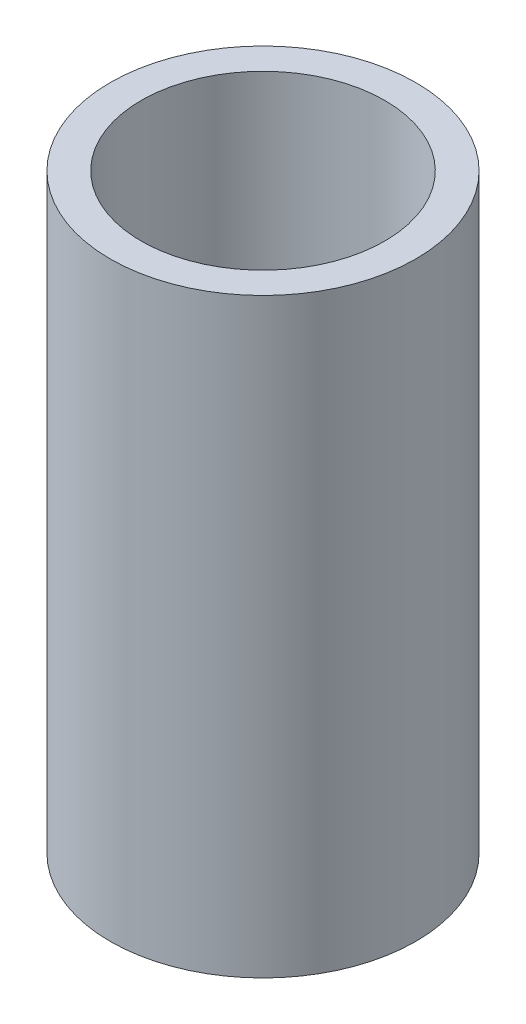
ISO-10303-21;
HEADER;
FILE_DESCRIPTION(('STEP AP214'),'2;1');
FILE_NAME('part.step','',(''),(''),'','','');
FILE_SCHEMA(('AUTOMOTIVE_DESIGN { 1 0 10303 214 1 1 1 1 }'));
ENDSEC;
DATA;
#1=APPLICATION_CONTEXT('core data for automotive mechanical design processes');
#2=APPLICATION_PROTOCOL_DEFINITION('international standard','automotive_design',2000,#1);
#3=PRODUCT_CONTEXT('',#1,'mechanical');
#4=PRODUCT('Part','Part','',(#3));
#5=PRODUCT_RELATED_PRODUCT_CATEGORY('part','',(#4));
#6=PRODUCT_DEFINITION_FORMATION('','',#4);
#7=PRODUCT_DEFINITION_CONTEXT('part definition',#1,'design');
#8=PRODUCT_DEFINITION('design','',#6,#7);
#9=PRODUCT_DEFINITION_SHAPE('','',#8);
#10=(LENGTH_UNIT() NAMED_UNIT(*) SI_UNIT(.MILLI.,.METRE.));
#11=(NAMED_UNIT(*) PLANE_ANGLE_UNIT() SI_UNIT($,.RADIAN.));
#12=(NAMED_UNIT(*) SI_UNIT($,.STERADIAN.) SOLID_ANGLE_UNIT());
#13=UNCERTAINTY_MEASURE_WITH_UNIT(LENGTH_MEASURE(1.E-05),#10,'distance_accuracy_value','');
#14=(GEOMETRIC_REPRESENTATION_CONTEXT(3) GLOBAL_UNCERTAINTY_ASSIGNED_CONTEXT((#13)) GLOBAL_UNIT_ASSIGNED_CONTEXT((#10,
#11,#12)) REPRESENTATION_CONTEXT('',''));
#15=CARTESIAN_POINT('',(0.,0.,0.));
#16=DIRECTION('',(0.,0.,1.));
#17=DIRECTION('',(1.,0.,0.));
#18=AXIS2_PLACEMENT_3D('',#15,#16,#17);
#19=CARTESIAN_POINT('',(0.,106.386436570976,0.));
#20=DIRECTION('',(0.,-1.,0.));
#21=DIRECTION('',(0.,0.,-1.));
#22=AXIS2_PLACEMENT_3D('',#19,#20,#21);
#23=CYLINDRICAL_SURFACE('',#22,27.5);
#24=CARTESIAN_POINT('',(0.,106.386436570976,0.));
#25=DIRECTION('',(0.,1.,0.));
#26=DIRECTION('',(0.,0.,1.));
#27=AXIS2_PLACEMENT_3D('',#24,#25,#26);
#28=CIRCLE('',#27,27.5);
#29=CARTESIAN_POINT('',(0.,106.386436570976,-27.5));
#30=VERTEX_POINT('',#29);
#31=EDGE_CURVE('E10',#30,#30,#28,.T.);
#32=CARTESIAN_POINT('',(0.,0.,0.));
#33=DIRECTION('',(0.,1.,0.));
#34=DIRECTION('',(0.,0.,1.));
#35=AXIS2_PLACEMENT_3D('',#32,#33,#34);
#36=CIRCLE('',#35,27.5);
#37=CARTESIAN_POINT('',(0.,0.,-27.5));
#38=VERTEX_POINT('',#37);
#39=EDGE_CURVE('E37',#38,#38,#36,.T.);
#40=CARTESIAN_POINT('',(0.,106.386436570976,-27.5));
#41=CARTESIAN_POINT('',(0.,105.278244523362,-27.5));
#42=CARTESIAN_POINT('',(0.,104.170052475747,-27.5));
#43=CARTESIAN_POINT('',(0.,101.953668380519,-27.5));
#44=CARTESIAN_POINT('',(0.,100.845476332904,-27.5));
#45=CARTESIAN_POINT('',(0.,98.6290922376758,-27.5));
#46=CARTESIAN_POINT('',(0.,97.5209001900615,-27.5));
#47=CARTESIAN_POINT('',(0.,95.3045160948328,-27.5));
#48=CARTESIAN_POINT('',(0.,94.1963240472185,-27.5));
#49=CARTESIAN_POINT('',(0.,91.9799399519898,-27.5));
#50=CARTESIAN_POINT('',(0.,90.8717479043755,-27.5));
#51=CARTESIAN_POINT('',(0.,88.6553638091468,-27.5));
#52=CARTESIAN_POINT('',(0.,87.5471717615325,-27.5));
#53=CARTESIAN_POINT('',(0.,85.3307876663038,-27.5));
#54=CARTESIAN_POINT('',(0.,84.2225956186895,-27.5));
#55=CARTESIAN_POINT('',(0.,82.0062115234608,-27.5));
#56=CARTESIAN_POINT('',(0.,80.8980194758465,-27.5));
#57=CARTESIAN_POINT('',(0.,78.6816353806178,-27.5));
#58=CARTESIAN_POINT('',(0.,77.5734433330035,-27.5));
#59=CARTESIAN_POINT('',(0.,75.3570592377748,-27.5));
#60=CARTESIAN_POINT('',(0.,74.2488671901605,-27.5));
#61=CARTESIAN_POINT('',(0.,72.0324830949318,-27.5));
#62=CARTESIAN_POINT('',(0.,70.9242910473175,-27.5));
#63=CARTESIAN_POINT('',(0.,68.7079069520888,-27.5));
#64=CARTESIAN_POINT('',(0.,67.5997149044744,-27.5));
#65=CARTESIAN_POINT('',(0.,65.3833308092458,-27.5));
#66=CARTESIAN_POINT('',(0.,64.2751387616314,-27.5));
#67=CARTESIAN_POINT('',(0.,62.0587546664028,-27.5));
#68=CARTESIAN_POINT('',(0.,60.9505626187884,-27.5));
#69=CARTESIAN_POINT('',(0.,58.7341785235598,-27.5));
#70=CARTESIAN_POINT('',(0.,57.6259864759454,-27.5));
#71=CARTESIAN_POINT('',(0.,55.4096023807168,-27.5));
#72=CARTESIAN_POINT('',(0.,54.3014103331024,-27.5));
#73=CARTESIAN_POINT('',(0.,52.0850262378737,-27.5));
#74=CARTESIAN_POINT('',(0.,50.9768341902594,-27.5));
#75=CARTESIAN_POINT('',(0.,48.7604500950307,-27.5));
#76=CARTESIAN_POINT('',(0.,47.6522580474164,-27.5));
#77=CARTESIAN_POINT('',(0.,45.4358739521877,-27.5));
#78=CARTESIAN_POINT('',(0.,44.3276819045734,-27.5));
#79=CARTESIAN_POINT('',(0.,42.1112978093447,-27.5));
#80=CARTESIAN_POINT('',(0.,41.0031057617304,-27.5));
#81=CARTESIAN_POINT('',(0.,38.7867216665017,-27.5));
#82=CARTESIAN_POINT('',(0.,37.6785296188874,-27.5));
#83=CARTESIAN_POINT('',(0.,35.4621455236587,-27.5));
#84=CARTESIAN_POINT('',(0.,34.3539534760444,-27.5));
#85=CARTESIAN_POINT('',(0.,32.1375693808157,-27.5));
#86=CARTESIAN_POINT('',(0.,31.0293773332014,-27.5));
#87=CARTESIAN_POINT('',(0.,28.8129932379727,-27.5));
#88=CARTESIAN_POINT('',(0.,27.7048011903584,-27.5));
#89=CARTESIAN_POINT('',(0.,25.4884170951297,-27.5));
#90=CARTESIAN_POINT('',(0.,24.3802250475154,-27.5));
#91=CARTESIAN_POINT('',(0.,22.1638409522867,-27.5));
#92=CARTESIAN_POINT('',(0.,21.0556489046724,-27.5));
#93=CARTESIAN_POINT('',(0.,18.8392648094437,-27.5));
#94=CARTESIAN_POINT('',(0.,17.7310727618294,-27.5));
#95=CARTESIAN_POINT('',(0.,15.5146886666007,-27.5));
#96=CARTESIAN_POINT('',(0.,14.4064966189864,-27.5));
#97=CARTESIAN_POINT('',(0.,12.1901125237577,-27.5));
#98=CARTESIAN_POINT('',(0.,11.0819204761434,-27.5));
#99=CARTESIAN_POINT('',(0.,8.86553638091468,-27.5));
#100=CARTESIAN_POINT('',(0.,7.75734433330035,-27.5));
#101=CARTESIAN_POINT('',(0.,5.54096023807168,-27.5));
#102=CARTESIAN_POINT('',(0.,4.43276819045734,-27.5));
#103=CARTESIAN_POINT('',(0.,2.21638409522867,-27.5));
#104=CARTESIAN_POINT('',(0.,1.10819204761434,-27.5));
#105=CARTESIAN_POINT('',(0.,0.,-27.5));
#106=B_SPLINE_CURVE_WITH_KNOTS('',3,(#40,#41,#42,#43,#44,#45,#46,#47,#48,#49,#50,#51,#52,#53,
#54,#55,#56,#57,#58,#59,#60,#61,#62,#63,#64,#65,#66,#67,#68,#69,#70,#71,#72,#73,#74,#75,#76,#77,
#78,#79,#80,#81,#82,#83,#84,#85,#86,#87,#88,#89,#90,#91,#92,#93,#94,#95,#96,#97,#98,#99,#100,
#101,#102,#103,#104,#105),.UNSPECIFIED.,.F.,.F.,(4,2,2,2,2,2,2,2,2,2,2,2,2,2,2,2,2,2,2,2,2,2,2,
2,2,2,2,2,2,2,2,2,4),(0.,3.324576142843,6.64915228568601,9.97372842852901,13.298304571372,
16.622880714215,19.947456857058,23.272032999901,26.596609142744,29.921185285587,33.24576142843,
36.570337571273,39.8949137141161,43.2194898569591,46.5440659998021,49.8686421426451,
53.1932182854881,56.5177944283311,59.8423705711741,63.1669467140171,66.4915228568601,
69.8160989997031,73.1406751425461,76.4652512853891,79.7898274282321,83.1144035710751,
86.4389797139181,89.7635558567611,93.0881319996041,96.4127081424471,99.7372842852901,
103.061860428133,106.386436570976),.UNSPECIFIED.);
#107=EDGE_CURVE('BSEAM40',#30,#38,#106,.T.);
#108=ORIENTED_EDGE('',*,*,#31,.F.);
#109=ORIENTED_EDGE('',*,*,#39,.T.);
#110=ORIENTED_EDGE('',*,*,#107,.T.);
#111=ORIENTED_EDGE('',*,*,#107,.F.);
#112=EDGE_LOOP('',(#108,#110,#109,#111));
#113=FACE_BOUND('',#112,.T.);
#114=ADVANCED_FACE('F40',(#113),#23,.T.);
#115=CARTESIAN_POINT('',(0.,106.386436570976,0.));
#116=DIRECTION('',(0.,1.,0.));
#117=DIRECTION('',(0.,0.,1.));
#118=AXIS2_PLACEMENT_3D('',#115,#116,#117);
#119=PLANE('',#118);
#120=CARTESIAN_POINT('',(0.,106.386436570976,0.));
#121=DIRECTION('',(0.,1.,0.));
#122=DIRECTION('',(0.,0.,1.));
#123=AXIS2_PLACEMENT_3D('',#120,#121,#122);
#124=CIRCLE('',#123,21.9294507232119);
#125=CARTESIAN_POINT('',(0.,106.386436570976,-21.9294507232119));
#126=VERTEX_POINT('',#125);
#127=EDGE_CURVE('E50',#126,#126,#124,.T.);
#128=ORIENTED_EDGE('',*,*,#127,.F.);
#129=EDGE_LOOP('',(#128));
#130=FACE_BOUND('',#129,.T.);
#131=ORIENTED_EDGE('',*,*,#31,.T.);
#132=EDGE_LOOP('',(#131));
#133=FACE_BOUND('',#132,.T.);
#134=ADVANCED_FACE('F59',(#130,#133),#119,.T.);
#135=CARTESIAN_POINT('',(0.,0.,0.));
#136=DIRECTION('',(0.,1.,0.));
#137=DIRECTION('',(0.,0.,1.));
#138=AXIS2_PLACEMENT_3D('',#135,#136,#137);
#139=PLANE('',#138);
#140=CARTESIAN_POINT('',(0.,0.,0.));
#141=DIRECTION('',(0.,1.,0.));
#142=DIRECTION('',(0.,0.,1.));
#143=AXIS2_PLACEMENT_3D('',#140,#141,#142);
#144=CIRCLE('',#143,21.9294507232119);
#145=CARTESIAN_POINT('',(0.,0.,-21.9294507232119));
#146=VERTEX_POINT('',#145);
#147=EDGE_CURVE('E47',#146,#146,#144,.T.);
#148=ORIENTED_EDGE('',*,*,#147,.T.);
#149=EDGE_LOOP('',(#148));
#150=FACE_BOUND('',#149,.T.);
#151=ORIENTED_EDGE('',*,*,#39,.F.);
#152=EDGE_LOOP('',(#151));
#153=FACE_BOUND('',#152,.T.);
#154=ADVANCED_FACE('F58',(#150,#153),#139,.F.);
#155=CARTESIAN_POINT('',(0.,106.386436570976,0.));
#156=DIRECTION('',(0.,-1.,0.));
#157=DIRECTION('',(0.,0.,-1.));
#158=AXIS2_PLACEMENT_3D('',#155,#156,#157);
#159=CYLINDRICAL_SURFACE('',#158,21.9294507232119);
#160=CARTESIAN_POINT('',(0.,106.386436570976,-21.9294507232119));
#161=CARTESIAN_POINT('',(0.,105.278244523362,-21.9294507232119));
#162=CARTESIAN_POINT('',(0.,104.170052475747,-21.9294507232119));
#163=CARTESIAN_POINT('',(0.,101.953668380519,-21.9294507232119));
#164=CARTESIAN_POINT('',(0.,100.845476332904,-21.9294507232119));
#165=CARTESIAN_POINT('',(0.,98.6290922376758,-21.9294507232119));
#166=CARTESIAN_POINT('',(0.,97.5209001900615,-21.9294507232119));
#167=CARTESIAN_POINT('',(0.,95.3045160948328,-21.9294507232119));
#168=CARTESIAN_POINT('',(0.,94.1963240472185,-21.9294507232119));
#169=CARTESIAN_POINT('',(0.,91.9799399519898,-21.9294507232119));
#170=CARTESIAN_POINT('',(0.,90.8717479043755,-21.9294507232119));
#171=CARTESIAN_POINT('',(0.,88.6553638091468,-21.9294507232119));
#172=CARTESIAN_POINT('',(0.,87.5471717615325,-21.9294507232119));
#173=CARTESIAN_POINT('',(0.,85.3307876663038,-21.9294507232119));
#174=CARTESIAN_POINT('',(0.,84.2225956186895,-21.9294507232119));
#175=CARTESIAN_POINT('',(0.,82.0062115234608,-21.9294507232119));
#176=CARTESIAN_POINT('',(0.,80.8980194758465,-21.9294507232119));
#177=CARTESIAN_POINT('',(0.,78.6816353806178,-21.9294507232119));
#178=CARTESIAN_POINT('',(0.,77.5734433330035,-21.9294507232119));
#179=CARTESIAN_POINT('',(0.,75.3570592377748,-21.9294507232119));
#180=CARTESIAN_POINT('',(0.,74.2488671901605,-21.9294507232119));
#181=CARTESIAN_POINT('',(0.,72.0324830949318,-21.9294507232119));
#182=CARTESIAN_POINT('',(0.,70.9242910473174,-21.9294507232119));
#183=CARTESIAN_POINT('',(0.,68.7079069520888,-21.9294507232119));
#184=CARTESIAN_POINT('',(0.,67.5997149044744,-21.9294507232119));
#185=CARTESIAN_POINT('',(0.,65.3833308092458,-21.9294507232119));
#186=CARTESIAN_POINT('',(0.,64.2751387616314,-21.9294507232119));
#187=CARTESIAN_POINT('',(0.,62.0587546664028,-21.9294507232119));
#188=CARTESIAN_POINT('',(0.,60.9505626187884,-21.9294507232119));
#189=CARTESIAN_POINT('',(0.,58.7341785235597,-21.9294507232119));
#190=CARTESIAN_POINT('',(0.,57.6259864759454,-21.9294507232119));
#191=CARTESIAN_POINT('',(0.,55.4096023807167,-21.9294507232119));
#192=CARTESIAN_POINT('',(0.,54.3014103331024,-21.9294507232119));
#193=CARTESIAN_POINT('',(0.,52.0850262378737,-21.9294507232119));
#194=CARTESIAN_POINT('',(0.,50.9768341902594,-21.9294507232119));
#195=CARTESIAN_POINT('',(0.,48.7604500950307,-21.9294507232119));
#196=CARTESIAN_POINT('',(0.,47.6522580474164,-21.9294507232119));
#197=CARTESIAN_POINT('',(0.,45.4358739521877,-21.9294507232119));
#198=CARTESIAN_POINT('',(0.,44.3276819045734,-21.9294507232119));
#199=CARTESIAN_POINT('',(0.,42.1112978093447,-21.9294507232119));
#200=CARTESIAN_POINT('',(0.,41.0031057617304,-21.9294507232119));
#201=CARTESIAN_POINT('',(0.,38.7867216665017,-21.9294507232119));
#202=CARTESIAN_POINT('',(0.,37.6785296188874,-21.9294507232119));
#203=CARTESIAN_POINT('',(0.,35.4621455236587,-21.9294507232119));
#204=CARTESIAN_POINT('',(0.,34.3539534760444,-21.9294507232119));
#205=CARTESIAN_POINT('',(0.,32.1375693808157,-21.9294507232119));
#206=CARTESIAN_POINT('',(0.,31.0293773332014,-21.9294507232119));
#207=CARTESIAN_POINT('',(0.,28.8129932379727,-21.9294507232119));
#208=CARTESIAN_POINT('',(0.,27.7048011903584,-21.9294507232119));
#209=CARTESIAN_POINT('',(0.,25.4884170951297,-21.9294507232119));
#210=CARTESIAN_POINT('',(0.,24.3802250475154,-21.9294507232119));
#211=CARTESIAN_POINT('',(0.,22.1638409522867,-21.9294507232119));
#212=CARTESIAN_POINT('',(0.,21.0556489046724,-21.9294507232119));
#213=CARTESIAN_POINT('',(0.,18.8392648094437,-21.9294507232119));
#214=CARTESIAN_POINT('',(0.,17.7310727618294,-21.9294507232119));
#215=CARTESIAN_POINT('',(0.,15.5146886666007,-21.9294507232119));
#216=CARTESIAN_POINT('',(0.,14.4064966189864,-21.9294507232119));
#217=CARTESIAN_POINT('',(0.,12.1901125237577,-21.9294507232119));
#218=CARTESIAN_POINT('',(0.,11.0819204761434,-21.9294507232119));
#219=CARTESIAN_POINT('',(0.,8.86553638091468,-21.9294507232119));
#220=CARTESIAN_POINT('',(0.,7.75734433330035,-21.9294507232119));
#221=CARTESIAN_POINT('',(0.,5.54096023807168,-21.9294507232119));
#222=CARTESIAN_POINT('',(0.,4.43276819045734,-21.9294507232119));
#223=CARTESIAN_POINT('',(0.,2.21638409522867,-21.9294507232119));
#224=CARTESIAN_POINT('',(0.,1.10819204761434,-21.9294507232119));
#225=CARTESIAN_POINT('',(0.,0.,-21.9294507232119));
#226=B_SPLINE_CURVE_WITH_KNOTS('',3,(#160,#161,#162,#163,#164,#165,#166,#167,#168,#169,#170,
#171,#172,#173,#174,#175,#176,#177,#178,#179,#180,#181,#182,#183,#184,#185,#186,#187,#188,#189,
#190,#191,#192,#193,#194,#195,#196,#197,#198,#199,#200,#201,#202,#203,#204,#205,#206,#207,#208,
#209,#210,#211,#212,#213,#214,#215,#216,#217,#218,#219,#220,#221,#222,#223,#224,#225),
.UNSPECIFIED.,.F.,.F.,(4,2,2,2,2,2,2,2,2,2,2,2,2,2,2,2,2,2,2,2,2,2,2,2,2,2,2,2,2,2,2,2,4),(0.,
3.32457614284301,6.64915228568602,9.97372842852902,13.298304571372,16.622880714215,
19.947456857058,23.2720329999011,26.596609142744,29.9211852855871,33.2457614284301,
36.5703375712731,39.8949137141161,43.2194898569591,46.5440659998021,49.8686421426451,
53.1932182854881,56.5177944283311,59.8423705711741,63.1669467140171,66.4915228568601,
69.8160989997031,73.1406751425461,76.4652512853891,79.7898274282321,83.1144035710751,
86.4389797139181,89.7635558567611,93.0881319996042,96.4127081424471,99.7372842852902,
103.061860428133,106.386436570976),.UNSPECIFIED.);
#227=EDGE_CURVE('BSEAM54',#126,#146,#226,.T.);
#228=ORIENTED_EDGE('',*,*,#127,.T.);
#229=ORIENTED_EDGE('',*,*,#147,.F.);
#230=ORIENTED_EDGE('',*,*,#227,.T.);
#231=ORIENTED_EDGE('',*,*,#227,.F.);
#232=EDGE_LOOP('',(#228,#230,#229,#231));
#233=FACE_BOUND('',#232,.T.);
#234=ADVANCED_FACE('F54',(#233),#159,.F.);
#235=CLOSED_SHELL('',(#114,#134,#154,#234));
#236=MANIFOLD_SOLID_BREP('B2',#235);
#237=ADVANCED_BREP_SHAPE_REPRESENTATION('',(#18,#236),#14);
#238=SHAPE_DEFINITION_REPRESENTATION(#9,#237);
ENDSEC;
END-ISO-10303-21;
